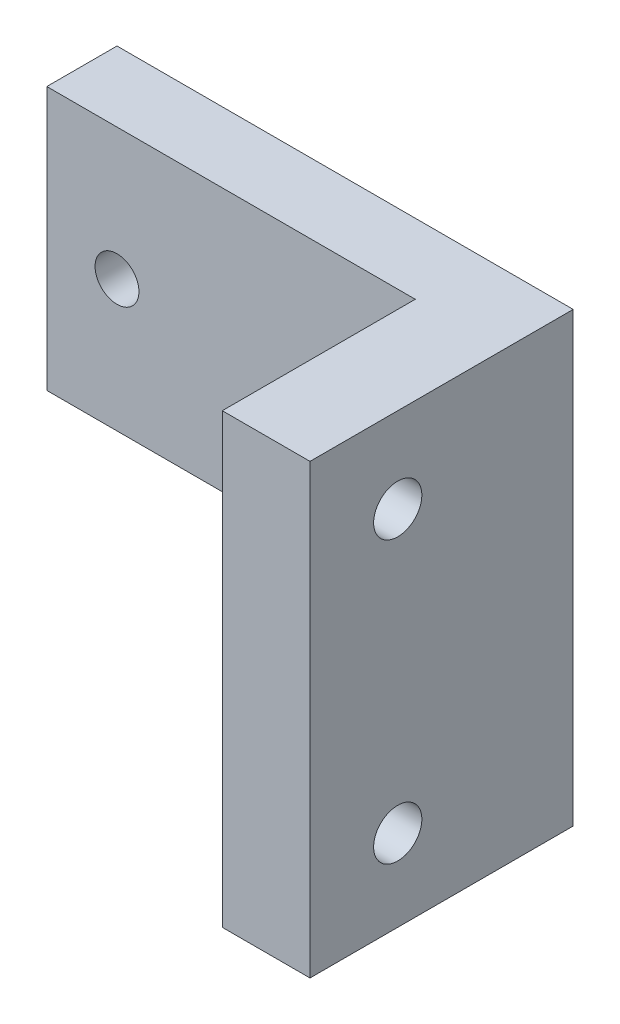
ISO-10303-21;
HEADER;
FILE_DESCRIPTION(('STEP AP214'),'2;1');
FILE_NAME('part.step','',(''),(''),'','','');
FILE_SCHEMA(('AUTOMOTIVE_DESIGN { 1 0 10303 214 1 1 1 1 }'));
ENDSEC;
DATA;
#1=APPLICATION_CONTEXT('core data for automotive mechanical design processes');
#2=APPLICATION_PROTOCOL_DEFINITION('international standard','automotive_design',2000,#1);
#3=PRODUCT_CONTEXT('',#1,'mechanical');
#4=PRODUCT('Part','Part','',(#3));
#5=PRODUCT_RELATED_PRODUCT_CATEGORY('part','',(#4));
#6=PRODUCT_DEFINITION_FORMATION('','',#4);
#7=PRODUCT_DEFINITION_CONTEXT('part definition',#1,'design');
#8=PRODUCT_DEFINITION('design','',#6,#7);
#9=PRODUCT_DEFINITION_SHAPE('','',#8);
#10=(LENGTH_UNIT() NAMED_UNIT(*) SI_UNIT(.MILLI.,.METRE.));
#11=(NAMED_UNIT(*) PLANE_ANGLE_UNIT() SI_UNIT($,.RADIAN.));
#12=(NAMED_UNIT(*) SI_UNIT($,.STERADIAN.) SOLID_ANGLE_UNIT());
#13=UNCERTAINTY_MEASURE_WITH_UNIT(LENGTH_MEASURE(1.E-05),#10,'distance_accuracy_value','');
#14=(GEOMETRIC_REPRESENTATION_CONTEXT(3) GLOBAL_UNCERTAINTY_ASSIGNED_CONTEXT((#13)) GLOBAL_UNIT_ASSIGNED_CONTEXT((#10,
#11,#12)) REPRESENTATION_CONTEXT('',''));
#15=CARTESIAN_POINT('',(0.,0.,0.));
#16=DIRECTION('',(0.,0.,1.));
#17=DIRECTION('',(1.,0.,0.));
#18=AXIS2_PLACEMENT_3D('',#15,#16,#17);
#19=CARTESIAN_POINT('',(0.,148.,8.));
#20=DIRECTION('',(0.,-1.,0.));
#21=DIRECTION('',(0.,0.,-1.));
#22=AXIS2_PLACEMENT_3D('',#19,#20,#21);
#23=PLANE('',#22);
#24=DIRECTION('',(-1.,0.,0.));
#25=VECTOR('',#24,1.);
#26=CARTESIAN_POINT('',(0.,148.,0.));
#27=LINE('',#26,#25);
#28=CARTESIAN_POINT('',(52.,148.,0.));
#29=VERTEX_POINT('',#28);
#30=CARTESIAN_POINT('',(0.,148.,0.));
#31=VERTEX_POINT('',#30);
#32=EDGE_CURVE('E131',#29,#31,#27,.T.);
#33=ORIENTED_EDGE('',*,*,#32,.T.);
#34=DIRECTION('',(0.,0.,-1.));
#35=VECTOR('',#34,1.);
#36=CARTESIAN_POINT('',(0.,148.,8.));
#37=LINE('',#36,#35);
#38=CARTESIAN_POINT('',(0.,148.,8.));
#39=VERTEX_POINT('',#38);
#40=EDGE_CURVE('E11',#39,#31,#37,.T.);
#41=ORIENTED_EDGE('',*,*,#40,.F.);
#42=DIRECTION('',(-1.,0.,0.));
#43=VECTOR('',#42,1.);
#44=CARTESIAN_POINT('',(0.,148.,8.));
#45=LINE('',#44,#43);
#46=CARTESIAN_POINT('',(42.,148.,8.));
#47=VERTEX_POINT('',#46);
#48=EDGE_CURVE('E157',#47,#39,#45,.T.);
#49=ORIENTED_EDGE('',*,*,#48,.F.);
#50=DIRECTION('',(0.,0.,-1.));
#51=VECTOR('',#50,1.);
#52=CARTESIAN_POINT('',(42.,148.,30.));
#53=LINE('',#52,#51);
#54=CARTESIAN_POINT('',(42.,148.,30.));
#55=VERTEX_POINT('',#54);
#56=EDGE_CURVE('E150',#55,#47,#53,.T.);
#57=ORIENTED_EDGE('',*,*,#56,.F.);
#58=DIRECTION('',(1.,0.,0.));
#59=VECTOR('',#58,1.);
#60=CARTESIAN_POINT('',(0.,148.,30.));
#61=LINE('',#60,#59);
#62=CARTESIAN_POINT('',(52.,148.,30.));
#63=VERTEX_POINT('',#62);
#64=EDGE_CURVE('E194',#55,#63,#61,.T.);
#65=ORIENTED_EDGE('',*,*,#64,.T.);
#66=DIRECTION('',(0.,0.,-1.));
#67=VECTOR('',#66,1.);
#68=CARTESIAN_POINT('',(52.,148.,30.));
#69=LINE('',#68,#67);
#70=EDGE_CURVE('E148',#63,#29,#69,.T.);
#71=ORIENTED_EDGE('',*,*,#70,.T.);
#72=EDGE_LOOP('',(#33,#41,#49,#57,#65,#71));
#73=FACE_BOUND('',#72,.T.);
#74=ADVANCED_FACE('F41',(#73),#23,.F.);
#75=CARTESIAN_POINT('',(0.,0.,8.));
#76=DIRECTION('',(1.,0.,0.));
#77=DIRECTION('',(0.,1.,0.));
#78=AXIS2_PLACEMENT_3D('',#75,#76,#77);
#79=PLANE('',#78);
#80=DIRECTION('',(0.,-1.,0.));
#81=VECTOR('',#80,1.);
#82=CARTESIAN_POINT('',(0.,0.,0.));
#83=LINE('',#82,#81);
#84=CARTESIAN_POINT('',(0.,118.,0.));
#85=VERTEX_POINT('',#84);
#86=EDGE_CURVE('E162',#31,#85,#83,.T.);
#87=ORIENTED_EDGE('',*,*,#86,.T.);
#88=DIRECTION('',(0.,0.,-1.));
#89=VECTOR('',#88,1.);
#90=CARTESIAN_POINT('',(0.,118.,8.));
#91=LINE('',#90,#89);
#92=CARTESIAN_POINT('',(0.,118.,8.));
#93=VERTEX_POINT('',#92);
#94=EDGE_CURVE('E51',#93,#85,#91,.T.);
#95=ORIENTED_EDGE('',*,*,#94,.F.);
#96=DIRECTION('',(0.,-1.,0.));
#97=VECTOR('',#96,1.);
#98=CARTESIAN_POINT('',(0.,0.,8.));
#99=LINE('',#98,#97);
#100=EDGE_CURVE('E90',#39,#93,#99,.T.);
#101=ORIENTED_EDGE('',*,*,#100,.F.);
#102=ORIENTED_EDGE('',*,*,#40,.T.);
#103=EDGE_LOOP('',(#87,#95,#101,#102));
#104=FACE_BOUND('',#103,.T.);
#105=ADVANCED_FACE('F259',(#104),#79,.F.);
#106=CARTESIAN_POINT('',(0.,118.,8.));
#107=DIRECTION('',(0.,-1.,0.));
#108=DIRECTION('',(0.,0.,-1.));
#109=AXIS2_PLACEMENT_3D('',#106,#107,#108);
#110=PLANE('',#109);
#111=DIRECTION('',(-1.,0.,0.));
#112=VECTOR('',#111,1.);
#113=CARTESIAN_POINT('',(0.,118.,0.));
#114=LINE('',#113,#112);
#115=CARTESIAN_POINT('',(42.,118.,0.));
#116=VERTEX_POINT('',#115);
#117=EDGE_CURVE('E165',#116,#85,#114,.T.);
#118=ORIENTED_EDGE('',*,*,#117,.F.);
#119=DIRECTION('',(0.,0.,-1.));
#120=VECTOR('',#119,1.);
#121=CARTESIAN_POINT('',(42.,118.,8.));
#122=LINE('',#121,#120);
#123=CARTESIAN_POINT('',(42.,118.,8.));
#124=VERTEX_POINT('',#123);
#125=EDGE_CURVE('E169',#124,#116,#122,.T.);
#126=ORIENTED_EDGE('',*,*,#125,.F.);
#127=DIRECTION('',(-1.,0.,0.));
#128=VECTOR('',#127,1.);
#129=CARTESIAN_POINT('',(0.,118.,8.));
#130=LINE('',#129,#128);
#131=EDGE_CURVE('E156',#124,#93,#130,.T.);
#132=ORIENTED_EDGE('',*,*,#131,.T.);
#133=ORIENTED_EDGE('',*,*,#94,.T.);
#134=EDGE_LOOP('',(#118,#126,#132,#133));
#135=FACE_BOUND('',#134,.T.);
#136=ADVANCED_FACE('F185',(#135),#110,.T.);
#137=CARTESIAN_POINT('',(0.,0.,8.));
#138=DIRECTION('',(0.,0.,1.));
#139=DIRECTION('',(1.,0.,0.));
#140=AXIS2_PLACEMENT_3D('',#137,#138,#139);
#141=PLANE('',#140);
#142=CARTESIAN_POINT('',(34.,133.,8.));
#143=DIRECTION('',(0.,0.,1.));
#144=DIRECTION('',(1.,0.,0.));
#145=AXIS2_PLACEMENT_3D('',#142,#143,#144);
#146=CIRCLE('',#145,2.5);
#147=CARTESIAN_POINT('',(36.5,133.,8.));
#148=VERTEX_POINT('',#147);
#149=EDGE_CURVE('E209',#148,#148,#146,.T.);
#150=ORIENTED_EDGE('',*,*,#149,.F.);
#151=EDGE_LOOP('',(#150));
#152=FACE_BOUND('',#151,.T.);
#153=CARTESIAN_POINT('',(7.99999999999999,133.,8.));
#154=DIRECTION('',(0.,0.,1.));
#155=DIRECTION('',(1.,0.,0.));
#156=AXIS2_PLACEMENT_3D('',#153,#154,#155);
#157=CIRCLE('',#156,2.5);
#158=CARTESIAN_POINT('',(10.5,133.,8.));
#159=VERTEX_POINT('',#158);
#160=EDGE_CURVE('E139',#159,#159,#157,.T.);
#161=ORIENTED_EDGE('',*,*,#160,.F.);
#162=EDGE_LOOP('',(#161));
#163=FACE_BOUND('',#162,.T.);
#164=ORIENTED_EDGE('',*,*,#48,.T.);
#165=ORIENTED_EDGE('',*,*,#100,.T.);
#166=ORIENTED_EDGE('',*,*,#131,.F.);
#167=DIRECTION('',(0.,1.,0.));
#168=VECTOR('',#167,1.);
#169=CARTESIAN_POINT('',(42.,0.,8.));
#170=LINE('',#169,#168);
#171=EDGE_CURVE('E68',#124,#47,#170,.T.);
#172=ORIENTED_EDGE('',*,*,#171,.T.);
#173=EDGE_LOOP('',(#164,#165,#166,#172));
#174=FACE_BOUND('',#173,.T.);
#175=ADVANCED_FACE('F254',(#152,#163,#174),#141,.T.);
#176=CARTESIAN_POINT('',(0.,0.,0.));
#177=DIRECTION('',(0.,0.,1.));
#178=DIRECTION('',(1.,0.,0.));
#179=AXIS2_PLACEMENT_3D('',#176,#177,#178);
#180=PLANE('',#179);
#181=CARTESIAN_POINT('',(34.,133.,0.));
#182=DIRECTION('',(0.,0.,1.));
#183=DIRECTION('',(1.,0.,0.));
#184=AXIS2_PLACEMENT_3D('',#181,#182,#183);
#185=CIRCLE('',#184,2.5);
#186=CARTESIAN_POINT('',(36.5,133.,0.));
#187=VERTEX_POINT('',#186);
#188=EDGE_CURVE('E205',#187,#187,#185,.F.);
#189=ORIENTED_EDGE('',*,*,#188,.F.);
#190=EDGE_LOOP('',(#189));
#191=FACE_BOUND('',#190,.T.);
#192=CARTESIAN_POINT('',(7.99999999999999,133.,0.));
#193=DIRECTION('',(0.,0.,1.));
#194=DIRECTION('',(1.,0.,0.));
#195=AXIS2_PLACEMENT_3D('',#192,#193,#194);
#196=CIRCLE('',#195,2.5);
#197=CARTESIAN_POINT('',(10.5,133.,0.));
#198=VERTEX_POINT('',#197);
#199=EDGE_CURVE('E134',#198,#198,#196,.F.);
#200=ORIENTED_EDGE('',*,*,#199,.F.);
#201=EDGE_LOOP('',(#200));
#202=FACE_BOUND('',#201,.T.);
#203=DIRECTION('',(0.,1.,0.));
#204=VECTOR('',#203,1.);
#205=CARTESIAN_POINT('',(52.,0.,0.));
#206=LINE('',#205,#204);
#207=CARTESIAN_POINT('',(52.,97.,0.));
#208=VERTEX_POINT('',#207);
#209=EDGE_CURVE('E124',#208,#29,#206,.T.);
#210=ORIENTED_EDGE('',*,*,#209,.F.);
#211=DIRECTION('',(-1.,0.,0.));
#212=VECTOR('',#211,1.);
#213=CARTESIAN_POINT('',(153.533245786787,97.,0.));
#214=LINE('',#213,#212);
#215=CARTESIAN_POINT('',(42.,97.,0.));
#216=VERTEX_POINT('',#215);
#217=EDGE_CURVE('E110',#208,#216,#214,.T.);
#218=ORIENTED_EDGE('',*,*,#217,.T.);
#219=DIRECTION('',(0.,1.,0.));
#220=VECTOR('',#219,1.);
#221=CARTESIAN_POINT('',(42.,0.,0.));
#222=LINE('',#221,#220);
#223=EDGE_CURVE('E44',#216,#116,#222,.T.);
#224=ORIENTED_EDGE('',*,*,#223,.T.);
#225=ORIENTED_EDGE('',*,*,#117,.T.);
#226=ORIENTED_EDGE('',*,*,#86,.F.);
#227=ORIENTED_EDGE('',*,*,#32,.F.);
#228=EDGE_LOOP('',(#210,#218,#224,#225,#226,#227));
#229=FACE_BOUND('',#228,.T.);
#230=ADVANCED_FACE('F129',(#191,#202,#229),#180,.F.);
#231=CARTESIAN_POINT('',(42.,0.,30.));
#232=DIRECTION('',(-1.,0.,0.));
#233=DIRECTION('',(0.,-1.,0.));
#234=AXIS2_PLACEMENT_3D('',#231,#232,#233);
#235=PLANE('',#234);
#236=DIRECTION('',(0.,0.,-1.));
#237=VECTOR('',#236,1.);
#238=CARTESIAN_POINT('',(42.,97.,30.));
#239=LINE('',#238,#237);
#240=CARTESIAN_POINT('',(42.,97.,30.));
#241=VERTEX_POINT('',#240);
#242=EDGE_CURVE('E113',#241,#216,#239,.T.);
#243=ORIENTED_EDGE('',*,*,#242,.F.);
#244=DIRECTION('',(0.,1.,0.));
#245=VECTOR('',#244,1.);
#246=CARTESIAN_POINT('',(42.,0.,30.));
#247=LINE('',#246,#245);
#248=EDGE_CURVE('E142',#241,#55,#247,.T.);
#249=ORIENTED_EDGE('',*,*,#248,.T.);
#250=ORIENTED_EDGE('',*,*,#56,.T.);
#251=ORIENTED_EDGE('',*,*,#171,.F.);
#252=ORIENTED_EDGE('',*,*,#125,.T.);
#253=ORIENTED_EDGE('',*,*,#223,.F.);
#254=EDGE_LOOP('',(#243,#249,#250,#251,#252,#253));
#255=FACE_BOUND('',#254,.T.);
#256=CARTESIAN_POINT('',(42.,106.3,20.));
#257=DIRECTION('',(-1.,0.,0.));
#258=DIRECTION('',(0.,-1.,0.));
#259=AXIS2_PLACEMENT_3D('',#256,#257,#258);
#260=CIRCLE('',#259,2.75);
#261=CARTESIAN_POINT('',(42.,103.55,20.));
#262=VERTEX_POINT('',#261);
#263=EDGE_CURVE('E221',#262,#262,#260,.F.);
#264=ORIENTED_EDGE('',*,*,#263,.T.);
#265=EDGE_LOOP('',(#264));
#266=FACE_BOUND('',#265,.T.);
#267=CARTESIAN_POINT('',(42.,138.3,20.));
#268=DIRECTION('',(-1.,0.,0.));
#269=DIRECTION('',(0.,-1.,0.));
#270=AXIS2_PLACEMENT_3D('',#267,#268,#269);
#271=CIRCLE('',#270,2.75);
#272=CARTESIAN_POINT('',(42.,135.55,20.));
#273=VERTEX_POINT('',#272);
#274=EDGE_CURVE('E213',#273,#273,#271,.F.);
#275=ORIENTED_EDGE('',*,*,#274,.T.);
#276=EDGE_LOOP('',(#275));
#277=FACE_BOUND('',#276,.T.);
#278=ADVANCED_FACE('F187',(#255,#266,#277),#235,.T.);
#279=CARTESIAN_POINT('',(52.,0.,30.));
#280=DIRECTION('',(-1.,0.,0.));
#281=DIRECTION('',(0.,0.,1.));
#282=AXIS2_PLACEMENT_3D('',#279,#280,#281);
#283=PLANE('',#282);
#284=CARTESIAN_POINT('',(52.,106.3,20.));
#285=DIRECTION('',(1.,0.,0.));
#286=DIRECTION('',(0.,0.,-1.));
#287=AXIS2_PLACEMENT_3D('',#284,#285,#286);
#288=CIRCLE('',#287,2.75);
#289=CARTESIAN_POINT('',(52.,106.3,17.25));
#290=VERTEX_POINT('',#289);
#291=EDGE_CURVE('E225',#290,#290,#288,.T.);
#292=ORIENTED_EDGE('',*,*,#291,.F.);
#293=EDGE_LOOP('',(#292));
#294=FACE_BOUND('',#293,.T.);
#295=CARTESIAN_POINT('',(52.,138.3,20.));
#296=DIRECTION('',(1.,0.,0.));
#297=DIRECTION('',(0.,0.,-1.));
#298=AXIS2_PLACEMENT_3D('',#295,#296,#297);
#299=CIRCLE('',#298,2.75);
#300=CARTESIAN_POINT('',(52.,138.3,17.25));
#301=VERTEX_POINT('',#300);
#302=EDGE_CURVE('E217',#301,#301,#299,.T.);
#303=ORIENTED_EDGE('',*,*,#302,.F.);
#304=EDGE_LOOP('',(#303));
#305=FACE_BOUND('',#304,.T.);
#306=DIRECTION('',(0.,1.,0.));
#307=VECTOR('',#306,1.);
#308=CARTESIAN_POINT('',(52.,0.,30.));
#309=LINE('',#308,#307);
#310=CARTESIAN_POINT('',(52.,97.,30.));
#311=VERTEX_POINT('',#310);
#312=EDGE_CURVE('E126',#311,#63,#309,.T.);
#313=ORIENTED_EDGE('',*,*,#312,.F.);
#314=DIRECTION('',(0.,0.,1.));
#315=VECTOR('',#314,1.);
#316=CARTESIAN_POINT('',(52.,97.,0.));
#317=LINE('',#316,#315);
#318=EDGE_CURVE('E59',#208,#311,#317,.T.);
#319=ORIENTED_EDGE('',*,*,#318,.F.);
#320=ORIENTED_EDGE('',*,*,#209,.T.);
#321=ORIENTED_EDGE('',*,*,#70,.F.);
#322=EDGE_LOOP('',(#313,#319,#320,#321));
#323=FACE_BOUND('',#322,.T.);
#324=ADVANCED_FACE('F122',(#294,#305,#323),#283,.F.);
#325=CARTESIAN_POINT('',(0.,0.,30.));
#326=DIRECTION('',(0.,0.,1.));
#327=DIRECTION('',(1.,0.,0.));
#328=AXIS2_PLACEMENT_3D('',#325,#326,#327);
#329=PLANE('',#328);
#330=DIRECTION('',(-1.,0.,0.));
#331=VECTOR('',#330,1.);
#332=CARTESIAN_POINT('',(153.533245786787,97.,30.));
#333=LINE('',#332,#331);
#334=EDGE_CURVE('E118',#311,#241,#333,.T.);
#335=ORIENTED_EDGE('',*,*,#334,.F.);
#336=ORIENTED_EDGE('',*,*,#312,.T.);
#337=ORIENTED_EDGE('',*,*,#64,.F.);
#338=ORIENTED_EDGE('',*,*,#248,.F.);
#339=EDGE_LOOP('',(#335,#336,#337,#338));
#340=FACE_BOUND('',#339,.T.);
#341=ADVANCED_FACE('F196',(#340),#329,.T.);
#342=CARTESIAN_POINT('',(7.99999999999999,133.,-7.07106781186548));
#343=DIRECTION('',(0.,0.,1.));
#344=DIRECTION('',(1.,0.,0.));
#345=AXIS2_PLACEMENT_3D('',#342,#343,#344);
#346=CYLINDRICAL_SURFACE('',#345,2.5);
#347=ORIENTED_EDGE('',*,*,#199,.T.);
#348=EDGE_LOOP('',(#347));
#349=FACE_BOUND('',#348,.T.);
#350=ORIENTED_EDGE('',*,*,#160,.T.);
#351=EDGE_LOOP('',(#350));
#352=FACE_BOUND('',#351,.T.);
#353=ADVANCED_FACE('F276',(#349,#352),#346,.F.);
#354=CARTESIAN_POINT('',(34.,133.,-7.07106781186548));
#355=DIRECTION('',(0.,0.,1.));
#356=DIRECTION('',(1.,0.,0.));
#357=AXIS2_PLACEMENT_3D('',#354,#355,#356);
#358=CYLINDRICAL_SURFACE('',#357,2.5);
#359=ORIENTED_EDGE('',*,*,#188,.T.);
#360=EDGE_LOOP('',(#359));
#361=FACE_BOUND('',#360,.T.);
#362=ORIENTED_EDGE('',*,*,#149,.T.);
#363=EDGE_LOOP('',(#362));
#364=FACE_BOUND('',#363,.T.);
#365=ADVANCED_FACE('F245',(#361,#364),#358,.F.);
#366=CARTESIAN_POINT('',(34.221825406948,138.3,20.));
#367=DIRECTION('',(1.,0.,0.));
#368=DIRECTION('',(0.,0.,-1.));
#369=AXIS2_PLACEMENT_3D('',#366,#367,#368);
#370=CYLINDRICAL_SURFACE('',#369,2.75);
#371=ORIENTED_EDGE('',*,*,#302,.T.);
#372=EDGE_LOOP('',(#371));
#373=FACE_BOUND('',#372,.T.);
#374=ORIENTED_EDGE('',*,*,#274,.F.);
#375=EDGE_LOOP('',(#374));
#376=FACE_BOUND('',#375,.T.);
#377=ADVANCED_FACE('F242',(#373,#376),#370,.F.);
#378=CARTESIAN_POINT('',(34.221825406948,106.3,20.));
#379=DIRECTION('',(1.,0.,0.));
#380=DIRECTION('',(0.,0.,-1.));
#381=AXIS2_PLACEMENT_3D('',#378,#379,#380);
#382=CYLINDRICAL_SURFACE('',#381,2.75);
#383=ORIENTED_EDGE('',*,*,#291,.T.);
#384=EDGE_LOOP('',(#383));
#385=FACE_BOUND('',#384,.T.);
#386=ORIENTED_EDGE('',*,*,#263,.F.);
#387=EDGE_LOOP('',(#386));
#388=FACE_BOUND('',#387,.T.);
#389=ADVANCED_FACE('F234',(#385,#388),#382,.F.);
#390=CARTESIAN_POINT('',(153.533245786787,97.,0.));
#391=DIRECTION('',(0.,1.,0.));
#392=DIRECTION('',(0.,0.,1.));
#393=AXIS2_PLACEMENT_3D('',#390,#391,#392);
#394=PLANE('',#393);
#395=ORIENTED_EDGE('',*,*,#242,.T.);
#396=ORIENTED_EDGE('',*,*,#217,.F.);
#397=ORIENTED_EDGE('',*,*,#318,.T.);
#398=ORIENTED_EDGE('',*,*,#334,.T.);
#399=EDGE_LOOP('',(#395,#396,#397,#398));
#400=FACE_BOUND('',#399,.T.);
#401=ADVANCED_FACE('F111',(#400),#394,.F.);
#402=CLOSED_SHELL('',(#74,#105,#136,#175,#230,#278,#324,#341,#353,#365,#377,#389,#401));
#403=MANIFOLD_SOLID_BREP('B2',#402);
#404=ADVANCED_BREP_SHAPE_REPRESENTATION('',(#18,#403),#14);
#405=SHAPE_DEFINITION_REPRESENTATION(#9,#404);
ENDSEC;
END-ISO-10303-21;
